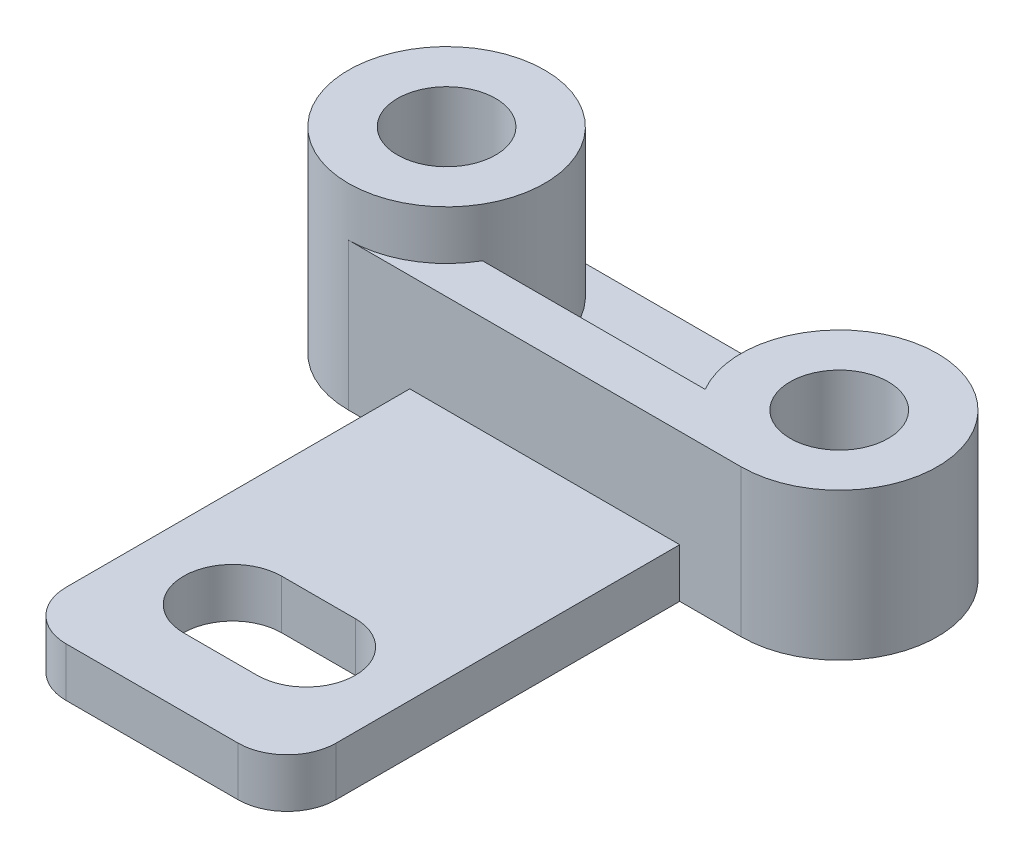
ISO-10303-21;
HEADER;
FILE_DESCRIPTION(('STEP AP214'),'2;1');
FILE_NAME('part.step','',(''),(''),'','','');
FILE_SCHEMA(('AUTOMOTIVE_DESIGN { 1 0 10303 214 1 1 1 1 }'));
ENDSEC;
DATA;
#1=APPLICATION_CONTEXT('core data for automotive mechanical design processes');
#2=APPLICATION_PROTOCOL_DEFINITION('international standard','automotive_design',2000,#1);
#3=PRODUCT_CONTEXT('',#1,'mechanical');
#4=PRODUCT('Part','Part','',(#3));
#5=PRODUCT_RELATED_PRODUCT_CATEGORY('part','',(#4));
#6=PRODUCT_DEFINITION_FORMATION('','',#4);
#7=PRODUCT_DEFINITION_CONTEXT('part definition',#1,'design');
#8=PRODUCT_DEFINITION('design','',#6,#7);
#9=PRODUCT_DEFINITION_SHAPE('','',#8);
#10=(LENGTH_UNIT() NAMED_UNIT(*) SI_UNIT(.MILLI.,.METRE.));
#11=(NAMED_UNIT(*) PLANE_ANGLE_UNIT() SI_UNIT($,.RADIAN.));
#12=(NAMED_UNIT(*) SI_UNIT($,.STERADIAN.) SOLID_ANGLE_UNIT());
#13=UNCERTAINTY_MEASURE_WITH_UNIT(LENGTH_MEASURE(1.E-05),#10,'distance_accuracy_value','');
#14=(GEOMETRIC_REPRESENTATION_CONTEXT(3) GLOBAL_UNCERTAINTY_ASSIGNED_CONTEXT((#13)) GLOBAL_UNIT_ASSIGNED_CONTEXT((#10,
#11,#12)) REPRESENTATION_CONTEXT('',''));
#15=CARTESIAN_POINT('',(0.,0.,0.));
#16=DIRECTION('',(0.,0.,1.));
#17=DIRECTION('',(1.,0.,0.));
#18=AXIS2_PLACEMENT_3D('',#15,#16,#17);
#19=CARTESIAN_POINT('',(0.,10.,0.));
#20=DIRECTION('',(0.,1.,0.));
#21=DIRECTION('',(0.,0.,1.));
#22=AXIS2_PLACEMENT_3D('',#19,#20,#21);
#23=PLANE('',#22);
#24=DIRECTION('',(0.,0.,-1.));
#25=VECTOR('',#24,1.);
#26=CARTESIAN_POINT('',(-27.5,10.,0.));
#27=LINE('',#26,#25);
#28=CARTESIAN_POINT('',(-27.5,10.,40.));
#29=VERTEX_POINT('',#28);
#30=CARTESIAN_POINT('',(-27.5,10.,-30.));
#31=VERTEX_POINT('',#30);
#32=EDGE_CURVE('E210',#29,#31,#27,.T.);
#33=ORIENTED_EDGE('',*,*,#32,.F.);
#34=CARTESIAN_POINT('',(-17.5,10.,40.));
#35=DIRECTION('',(0.,1.,0.));
#36=DIRECTION('',(0.,0.,1.));
#37=AXIS2_PLACEMENT_3D('',#34,#35,#36);
#38=CIRCLE('',#37,10.);
#39=CARTESIAN_POINT('',(-17.5,10.,50.));
#40=VERTEX_POINT('',#39);
#41=EDGE_CURVE('E56',#29,#40,#38,.T.);
#42=ORIENTED_EDGE('',*,*,#41,.T.);
#43=DIRECTION('',(1.,0.,0.));
#44=VECTOR('',#43,1.);
#45=CARTESIAN_POINT('',(0.,10.,50.));
#46=LINE('',#45,#44);
#47=CARTESIAN_POINT('',(17.5,10.,50.));
#48=VERTEX_POINT('',#47);
#49=EDGE_CURVE('E214',#40,#48,#46,.T.);
#50=ORIENTED_EDGE('',*,*,#49,.T.);
#51=CARTESIAN_POINT('',(17.5,10.,40.));
#52=DIRECTION('',(0.,1.,0.));
#53=DIRECTION('',(0.,0.,1.));
#54=AXIS2_PLACEMENT_3D('',#51,#52,#53);
#55=CIRCLE('',#54,10.);
#56=CARTESIAN_POINT('',(27.5,10.,40.));
#57=VERTEX_POINT('',#56);
#58=EDGE_CURVE('E63',#48,#57,#55,.T.);
#59=ORIENTED_EDGE('',*,*,#58,.T.);
#60=DIRECTION('',(0.,0.,-1.));
#61=VECTOR('',#60,1.);
#62=CARTESIAN_POINT('',(27.5,10.,0.));
#63=LINE('',#62,#61);
#64=CARTESIAN_POINT('',(27.5,10.,-30.));
#65=VERTEX_POINT('',#64);
#66=EDGE_CURVE('E217',#57,#65,#63,.T.);
#67=ORIENTED_EDGE('',*,*,#66,.T.);
#68=DIRECTION('',(1.,0.,0.));
#69=VECTOR('',#68,1.);
#70=CARTESIAN_POINT('',(0.,10.,-30.));
#71=LINE('',#70,#69);
#72=EDGE_CURVE('E178',#31,#65,#71,.T.);
#73=ORIENTED_EDGE('',*,*,#72,.F.);
#74=EDGE_LOOP('',(#33,#42,#50,#59,#67,#73));
#75=FACE_BOUND('',#74,.T.);
#76=CARTESIAN_POINT('',(7.5,10.,26.094203660327));
#77=DIRECTION('',(0.,1.,0.));
#78=DIRECTION('',(0.,0.,1.));
#79=AXIS2_PLACEMENT_3D('',#76,#77,#78);
#80=CIRCLE('',#79,10.);
#81=CARTESIAN_POINT('',(7.50000000000001,10.,36.094203660327));
#82=VERTEX_POINT('',#81);
#83=CARTESIAN_POINT('',(7.5,10.,16.094203660327));
#84=VERTEX_POINT('',#83);
#85=EDGE_CURVE('E220',#82,#84,#80,.T.);
#86=ORIENTED_EDGE('',*,*,#85,.F.);
#87=DIRECTION('',(1.,0.,0.));
#88=VECTOR('',#87,1.);
#89=CARTESIAN_POINT('',(0.,10.,36.094203660327));
#90=LINE('',#89,#88);
#91=CARTESIAN_POINT('',(-7.5,10.,36.094203660327));
#92=VERTEX_POINT('',#91);
#93=EDGE_CURVE('E224',#92,#82,#90,.T.);
#94=ORIENTED_EDGE('',*,*,#93,.F.);
#95=CARTESIAN_POINT('',(-7.5,10.,26.094203660327));
#96=DIRECTION('',(0.,1.,0.));
#97=DIRECTION('',(0.,0.,1.));
#98=AXIS2_PLACEMENT_3D('',#95,#96,#97);
#99=CIRCLE('',#98,10.);
#100=CARTESIAN_POINT('',(-7.5,10.,16.094203660327));
#101=VERTEX_POINT('',#100);
#102=EDGE_CURVE('E228',#101,#92,#99,.T.);
#103=ORIENTED_EDGE('',*,*,#102,.F.);
#104=DIRECTION('',(1.,0.,0.));
#105=VECTOR('',#104,1.);
#106=CARTESIAN_POINT('',(0.,10.,16.094203660327));
#107=LINE('',#106,#105);
#108=EDGE_CURVE('E232',#101,#84,#107,.T.);
#109=ORIENTED_EDGE('',*,*,#108,.T.);
#110=EDGE_LOOP('',(#86,#94,#103,#109));
#111=FACE_BOUND('',#110,.T.);
#112=ADVANCED_FACE('F47',(#75,#111),#23,.T.);
#113=CARTESIAN_POINT('',(7.5,10.,26.094203660327));
#114=DIRECTION('',(0.,-1.,0.));
#115=DIRECTION('',(0.,0.,-1.));
#116=AXIS2_PLACEMENT_3D('',#113,#114,#115);
#117=CYLINDRICAL_SURFACE('',#116,10.);
#118=CARTESIAN_POINT('',(7.5,0.,26.094203660327));
#119=DIRECTION('',(0.,1.,0.));
#120=DIRECTION('',(0.,0.,1.));
#121=AXIS2_PLACEMENT_3D('',#118,#119,#120);
#122=CIRCLE('',#121,10.);
#123=CARTESIAN_POINT('',(7.50000000000001,0.,36.094203660327));
#124=VERTEX_POINT('',#123);
#125=CARTESIAN_POINT('',(7.5,0.,16.094203660327));
#126=VERTEX_POINT('',#125);
#127=EDGE_CURVE('E265',#124,#126,#122,.T.);
#128=ORIENTED_EDGE('',*,*,#127,.F.);
#129=DIRECTION('',(0.,-1.,0.));
#130=VECTOR('',#129,1.);
#131=CARTESIAN_POINT('',(7.50000000000001,10.,36.094203660327));
#132=LINE('',#131,#130);
#133=EDGE_CURVE('E290',#82,#124,#132,.T.);
#134=ORIENTED_EDGE('',*,*,#133,.F.);
#135=ORIENTED_EDGE('',*,*,#85,.T.);
#136=DIRECTION('',(0.,-1.,0.));
#137=VECTOR('',#136,1.);
#138=CARTESIAN_POINT('',(7.5,10.,16.094203660327));
#139=LINE('',#138,#137);
#140=EDGE_CURVE('E280',#84,#126,#139,.T.);
#141=ORIENTED_EDGE('',*,*,#140,.T.);
#142=EDGE_LOOP('',(#128,#134,#135,#141));
#143=FACE_BOUND('',#142,.T.);
#144=ADVANCED_FACE('F395',(#143),#117,.F.);
#145=CARTESIAN_POINT('',(0.,10.,36.094203660327));
#146=DIRECTION('',(0.,0.,-1.));
#147=DIRECTION('',(-1.,0.,0.));
#148=AXIS2_PLACEMENT_3D('',#145,#146,#147);
#149=PLANE('',#148);
#150=DIRECTION('',(1.,0.,0.));
#151=VECTOR('',#150,1.);
#152=CARTESIAN_POINT('',(0.,0.,36.094203660327));
#153=LINE('',#152,#151);
#154=CARTESIAN_POINT('',(-7.5,0.,36.094203660327));
#155=VERTEX_POINT('',#154);
#156=EDGE_CURVE('E269',#155,#124,#153,.T.);
#157=ORIENTED_EDGE('',*,*,#156,.F.);
#158=DIRECTION('',(0.,-1.,0.));
#159=VECTOR('',#158,1.);
#160=CARTESIAN_POINT('',(-7.5,10.,36.094203660327));
#161=LINE('',#160,#159);
#162=EDGE_CURVE('E287',#92,#155,#161,.T.);
#163=ORIENTED_EDGE('',*,*,#162,.F.);
#164=ORIENTED_EDGE('',*,*,#93,.T.);
#165=ORIENTED_EDGE('',*,*,#133,.T.);
#166=EDGE_LOOP('',(#157,#163,#164,#165));
#167=FACE_BOUND('',#166,.T.);
#168=ADVANCED_FACE('F406',(#167),#149,.T.);
#169=CARTESIAN_POINT('',(-7.5,10.,26.094203660327));
#170=DIRECTION('',(0.,-1.,0.));
#171=DIRECTION('',(0.,0.,-1.));
#172=AXIS2_PLACEMENT_3D('',#169,#170,#171);
#173=CYLINDRICAL_SURFACE('',#172,10.);
#174=CARTESIAN_POINT('',(-7.5,0.,26.094203660327));
#175=DIRECTION('',(0.,1.,0.));
#176=DIRECTION('',(0.,0.,1.));
#177=AXIS2_PLACEMENT_3D('',#174,#175,#176);
#178=CIRCLE('',#177,10.);
#179=CARTESIAN_POINT('',(-7.5,0.,16.094203660327));
#180=VERTEX_POINT('',#179);
#181=EDGE_CURVE('E273',#180,#155,#178,.T.);
#182=ORIENTED_EDGE('',*,*,#181,.F.);
#183=DIRECTION('',(0.,-1.,0.));
#184=VECTOR('',#183,1.);
#185=CARTESIAN_POINT('',(-7.5,10.,16.094203660327));
#186=LINE('',#185,#184);
#187=EDGE_CURVE('E283',#101,#180,#186,.T.);
#188=ORIENTED_EDGE('',*,*,#187,.F.);
#189=ORIENTED_EDGE('',*,*,#102,.T.);
#190=ORIENTED_EDGE('',*,*,#162,.T.);
#191=EDGE_LOOP('',(#182,#188,#189,#190));
#192=FACE_BOUND('',#191,.T.);
#193=ADVANCED_FACE('F403',(#192),#173,.F.);
#194=CARTESIAN_POINT('',(40.,10.,-50.));
#195=DIRECTION('',(0.,-1.,0.));
#196=DIRECTION('',(0.,0.,-1.));
#197=AXIS2_PLACEMENT_3D('',#194,#195,#196);
#198=CYLINDRICAL_SURFACE('',#197,20.);
#199=CARTESIAN_POINT('',(40.,0.,-50.));
#200=DIRECTION('',(0.,1.,0.));
#201=DIRECTION('',(0.,0.,1.));
#202=AXIS2_PLACEMENT_3D('',#199,#200,#201);
#203=CIRCLE('',#202,20.);
#204=CARTESIAN_POINT('',(40.,0.,-70.));
#205=VERTEX_POINT('',#204);
#206=CARTESIAN_POINT('',(40.,0.,-30.));
#207=VERTEX_POINT('',#206);
#208=EDGE_CURVE('E239',#205,#207,#203,.F.);
#209=ORIENTED_EDGE('',*,*,#208,.F.);
#210=DIRECTION('',(0.,-1.,0.));
#211=VECTOR('',#210,1.);
#212=CARTESIAN_POINT('',(40.,10.,-70.));
#213=LINE('',#212,#211);
#214=CARTESIAN_POINT('',(40.,10.,-70.));
#215=VERTEX_POINT('',#214);
#216=EDGE_CURVE('E306',#215,#205,#213,.T.);
#217=ORIENTED_EDGE('',*,*,#216,.F.);
#218=CARTESIAN_POINT('',(40.,10.,-50.));
#219=DIRECTION('',(0.,1.,0.));
#220=DIRECTION('',(0.,0.,1.));
#221=AXIS2_PLACEMENT_3D('',#218,#219,#220);
#222=CIRCLE('',#221,20.);
#223=CARTESIAN_POINT('',(22.6794919243113,10.,-40.));
#224=VERTEX_POINT('',#223);
#225=EDGE_CURVE('E293',#215,#224,#222,.T.);
#226=ORIENTED_EDGE('',*,*,#225,.T.);
#227=DIRECTION('',(0.,-1.,0.));
#228=VECTOR('',#227,1.);
#229=CARTESIAN_POINT('',(22.6794919243113,30.,-40.));
#230=LINE('',#229,#228);
#231=CARTESIAN_POINT('',(22.6794919243113,30.,-40.));
#232=VERTEX_POINT('',#231);
#233=EDGE_CURVE('E196',#232,#224,#230,.T.);
#234=ORIENTED_EDGE('',*,*,#233,.F.);
#235=CARTESIAN_POINT('',(40.,30.,-50.));
#236=DIRECTION('',(0.,1.,0.));
#237=DIRECTION('',(0.,0.,1.));
#238=AXIS2_PLACEMENT_3D('',#235,#236,#237);
#239=CIRCLE('',#238,20.);
#240=CARTESIAN_POINT('',(40.,30.,-30.));
#241=VERTEX_POINT('',#240);
#242=EDGE_CURVE('E184',#241,#232,#239,.T.);
#243=ORIENTED_EDGE('',*,*,#242,.F.);
#244=DIRECTION('',(0.,-1.,0.));
#245=VECTOR('',#244,1.);
#246=CARTESIAN_POINT('',(40.,10.,-30.));
#247=LINE('',#246,#245);
#248=EDGE_CURVE('E284',#241,#207,#247,.T.);
#249=ORIENTED_EDGE('',*,*,#248,.T.);
#250=EDGE_LOOP('',(#209,#217,#226,#234,#243,#249));
#251=FACE_BOUND('',#250,.T.);
#252=ADVANCED_FACE('F425',(#251),#198,.T.);
#253=CARTESIAN_POINT('',(0.,10.,-70.));
#254=DIRECTION('',(0.,0.,-1.));
#255=DIRECTION('',(-1.,0.,0.));
#256=AXIS2_PLACEMENT_3D('',#253,#254,#255);
#257=PLANE('',#256);
#258=DIRECTION('',(1.,0.,0.));
#259=VECTOR('',#258,1.);
#260=CARTESIAN_POINT('',(0.,0.,-70.));
#261=LINE('',#260,#259);
#262=CARTESIAN_POINT('',(-40.,0.,-70.));
#263=VERTEX_POINT('',#262);
#264=EDGE_CURVE('E244',#263,#205,#261,.T.);
#265=ORIENTED_EDGE('',*,*,#264,.F.);
#266=DIRECTION('',(0.,-1.,0.));
#267=VECTOR('',#266,1.);
#268=CARTESIAN_POINT('',(-40.,10.,-70.));
#269=LINE('',#268,#267);
#270=CARTESIAN_POINT('',(-40.,10.,-70.));
#271=VERTEX_POINT('',#270);
#272=EDGE_CURVE('E303',#271,#263,#269,.T.);
#273=ORIENTED_EDGE('',*,*,#272,.F.);
#274=DIRECTION('',(1.,0.,0.));
#275=VECTOR('',#274,1.);
#276=CARTESIAN_POINT('',(0.,10.,-70.));
#277=LINE('',#276,#275);
#278=EDGE_CURVE('E206',#271,#215,#277,.T.);
#279=ORIENTED_EDGE('',*,*,#278,.T.);
#280=ORIENTED_EDGE('',*,*,#216,.T.);
#281=EDGE_LOOP('',(#265,#273,#279,#280));
#282=FACE_BOUND('',#281,.T.);
#283=ADVANCED_FACE('F428',(#282),#257,.T.);
#284=CARTESIAN_POINT('',(-40.,10.,-50.));
#285=DIRECTION('',(0.,-1.,0.));
#286=DIRECTION('',(0.,0.,-1.));
#287=AXIS2_PLACEMENT_3D('',#284,#285,#286);
#288=CYLINDRICAL_SURFACE('',#287,20.);
#289=CARTESIAN_POINT('',(-40.,10.,-50.));
#290=DIRECTION('',(0.,1.,0.));
#291=DIRECTION('',(0.,0.,1.));
#292=AXIS2_PLACEMENT_3D('',#289,#290,#291);
#293=CIRCLE('',#292,20.);
#294=CARTESIAN_POINT('',(-22.6794919243112,10.,-40.));
#295=VERTEX_POINT('',#294);
#296=EDGE_CURVE('E355',#295,#271,#293,.T.);
#297=ORIENTED_EDGE('',*,*,#296,.T.);
#298=ORIENTED_EDGE('',*,*,#272,.T.);
#299=CARTESIAN_POINT('',(-40.,0.,-50.));
#300=DIRECTION('',(0.,1.,0.));
#301=DIRECTION('',(0.,0.,1.));
#302=AXIS2_PLACEMENT_3D('',#299,#300,#301);
#303=CIRCLE('',#302,20.);
#304=CARTESIAN_POINT('',(-40.,0.,-30.));
#305=VERTEX_POINT('',#304);
#306=EDGE_CURVE('E248',#263,#305,#303,.T.);
#307=ORIENTED_EDGE('',*,*,#306,.T.);
#308=DIRECTION('',(0.,-1.,0.));
#309=VECTOR('',#308,1.);
#310=CARTESIAN_POINT('',(-40.,10.,-30.));
#311=LINE('',#310,#309);
#312=CARTESIAN_POINT('',(-40.,30.,-30.));
#313=VERTEX_POINT('',#312);
#314=EDGE_CURVE('E172',#313,#305,#311,.T.);
#315=ORIENTED_EDGE('',*,*,#314,.F.);
#316=CARTESIAN_POINT('',(-40.,30.,-50.));
#317=DIRECTION('',(0.,1.,0.));
#318=DIRECTION('',(0.,0.,1.));
#319=AXIS2_PLACEMENT_3D('',#316,#317,#318);
#320=CIRCLE('',#319,20.);
#321=CARTESIAN_POINT('',(-22.6794919243112,30.,-40.));
#322=VERTEX_POINT('',#321);
#323=EDGE_CURVE('E163',#322,#313,#320,.F.);
#324=ORIENTED_EDGE('',*,*,#323,.F.);
#325=DIRECTION('',(0.,-1.,0.));
#326=VECTOR('',#325,1.);
#327=CARTESIAN_POINT('',(-22.6794919243112,30.,-40.));
#328=LINE('',#327,#326);
#329=EDGE_CURVE('E169',#322,#295,#328,.T.);
#330=ORIENTED_EDGE('',*,*,#329,.T.);
#331=EDGE_LOOP('',(#297,#298,#307,#315,#324,#330));
#332=FACE_BOUND('',#331,.T.);
#333=CARTESIAN_POINT('',(-40.,40.,-50.));
#334=DIRECTION('',(0.,1.,0.));
#335=DIRECTION('',(0.,0.,1.));
#336=AXIS2_PLACEMENT_3D('',#333,#334,#335);
#337=CIRCLE('',#336,20.);
#338=CARTESIAN_POINT('',(-40.,40.,-30.));
#339=VERTEX_POINT('',#338);
#340=EDGE_CURVE('E360',#339,#339,#337,.T.);
#341=ORIENTED_EDGE('',*,*,#340,.F.);
#342=EDGE_LOOP('',(#341));
#343=FACE_BOUND('',#342,.T.);
#344=ADVANCED_FACE('F166',(#332,#343),#288,.T.);
#345=CARTESIAN_POINT('',(0.,10.,-30.));
#346=DIRECTION('',(0.,0.,-1.));
#347=DIRECTION('',(-1.,0.,0.));
#348=AXIS2_PLACEMENT_3D('',#345,#346,#347);
#349=PLANE('',#348);
#350=DIRECTION('',(1.,0.,0.));
#351=VECTOR('',#350,1.);
#352=CARTESIAN_POINT('',(0.,0.,-30.));
#353=LINE('',#352,#351);
#354=CARTESIAN_POINT('',(-27.5,0.,-30.));
#355=VERTEX_POINT('',#354);
#356=EDGE_CURVE('E240',#305,#355,#353,.T.);
#357=ORIENTED_EDGE('',*,*,#356,.T.);
#358=DIRECTION('',(0.,-1.,0.));
#359=VECTOR('',#358,1.);
#360=CARTESIAN_POINT('',(-27.5,10.,-30.));
#361=LINE('',#360,#359);
#362=EDGE_CURVE('E297',#31,#355,#361,.T.);
#363=ORIENTED_EDGE('',*,*,#362,.F.);
#364=ORIENTED_EDGE('',*,*,#72,.T.);
#365=DIRECTION('',(0.,-1.,0.));
#366=VECTOR('',#365,1.);
#367=CARTESIAN_POINT('',(27.5,10.,-30.));
#368=LINE('',#367,#366);
#369=CARTESIAN_POINT('',(27.5,0.,-30.));
#370=VERTEX_POINT('',#369);
#371=EDGE_CURVE('E234',#65,#370,#368,.T.);
#372=ORIENTED_EDGE('',*,*,#371,.T.);
#373=EDGE_CURVE('E201',#370,#207,#353,.T.);
#374=ORIENTED_EDGE('',*,*,#373,.T.);
#375=ORIENTED_EDGE('',*,*,#248,.F.);
#376=DIRECTION('',(1.,0.,0.));
#377=VECTOR('',#376,1.);
#378=CARTESIAN_POINT('',(0.,30.,-30.));
#379=LINE('',#378,#377);
#380=EDGE_CURVE('E189',#313,#241,#379,.T.);
#381=ORIENTED_EDGE('',*,*,#380,.F.);
#382=ORIENTED_EDGE('',*,*,#314,.T.);
#383=EDGE_LOOP('',(#357,#363,#364,#372,#374,#375,#381,#382));
#384=FACE_BOUND('',#383,.T.);
#385=ADVANCED_FACE('F347',(#384),#349,.F.);
#386=CARTESIAN_POINT('',(-27.5,10.,0.));
#387=DIRECTION('',(-1.,0.,0.));
#388=DIRECTION('',(0.,0.,1.));
#389=AXIS2_PLACEMENT_3D('',#386,#387,#388);
#390=PLANE('',#389);
#391=DIRECTION('',(0.,0.,-1.));
#392=VECTOR('',#391,1.);
#393=CARTESIAN_POINT('',(-27.5,0.,0.));
#394=LINE('',#393,#392);
#395=CARTESIAN_POINT('',(-27.5,0.,40.));
#396=VERTEX_POINT('',#395);
#397=EDGE_CURVE('E251',#396,#355,#394,.T.);
#398=ORIENTED_EDGE('',*,*,#397,.F.);
#399=DIRECTION('',(0.,-1.,0.));
#400=VECTOR('',#399,1.);
#401=CARTESIAN_POINT('',(-27.5,10.,40.));
#402=LINE('',#401,#400);
#403=EDGE_CURVE('E71',#396,#29,#402,.F.);
#404=ORIENTED_EDGE('',*,*,#403,.T.);
#405=ORIENTED_EDGE('',*,*,#32,.T.);
#406=ORIENTED_EDGE('',*,*,#362,.T.);
#407=EDGE_LOOP('',(#398,#404,#405,#406));
#408=FACE_BOUND('',#407,.T.);
#409=ADVANCED_FACE('F342',(#408),#390,.T.);
#410=CARTESIAN_POINT('',(0.,10.,50.));
#411=DIRECTION('',(0.,0.,-1.));
#412=DIRECTION('',(-1.,0.,0.));
#413=AXIS2_PLACEMENT_3D('',#410,#411,#412);
#414=PLANE('',#413);
#415=ORIENTED_EDGE('',*,*,#49,.F.);
#416=DIRECTION('',(0.,-1.,0.));
#417=VECTOR('',#416,1.);
#418=CARTESIAN_POINT('',(-17.5,0.,50.));
#419=LINE('',#418,#417);
#420=CARTESIAN_POINT('',(-17.5,0.,50.));
#421=VERTEX_POINT('',#420);
#422=EDGE_CURVE('E313',#40,#421,#419,.T.);
#423=ORIENTED_EDGE('',*,*,#422,.T.);
#424=DIRECTION('',(1.,0.,0.));
#425=VECTOR('',#424,1.);
#426=CARTESIAN_POINT('',(0.,0.,50.));
#427=LINE('',#426,#425);
#428=CARTESIAN_POINT('',(17.5,0.,50.));
#429=VERTEX_POINT('',#428);
#430=EDGE_CURVE('E254',#421,#429,#427,.T.);
#431=ORIENTED_EDGE('',*,*,#430,.T.);
#432=DIRECTION('',(0.,-1.,0.));
#433=VECTOR('',#432,1.);
#434=CARTESIAN_POINT('',(17.5,10.,50.));
#435=LINE('',#434,#433);
#436=EDGE_CURVE('E177',#429,#48,#435,.F.);
#437=ORIENTED_EDGE('',*,*,#436,.T.);
#438=EDGE_LOOP('',(#415,#423,#431,#437));
#439=FACE_BOUND('',#438,.T.);
#440=ADVANCED_FACE('F334',(#439),#414,.F.);
#441=CARTESIAN_POINT('',(-40.,10.,-50.));
#442=DIRECTION('',(0.,-1.,0.));
#443=DIRECTION('',(0.,0.,-1.));
#444=AXIS2_PLACEMENT_3D('',#441,#442,#443);
#445=CYLINDRICAL_SURFACE('',#444,10.);
#446=CARTESIAN_POINT('',(-40.,40.,-50.));
#447=DIRECTION('',(0.,1.,0.));
#448=DIRECTION('',(0.,0.,1.));
#449=AXIS2_PLACEMENT_3D('',#446,#447,#448);
#450=CIRCLE('',#449,10.);
#451=CARTESIAN_POINT('',(-40.,40.,-40.));
#452=VERTEX_POINT('',#451);
#453=EDGE_CURVE('E371',#452,#452,#450,.F.);
#454=ORIENTED_EDGE('',*,*,#453,.F.);
#455=EDGE_LOOP('',(#454));
#456=FACE_BOUND('',#455,.T.);
#457=CARTESIAN_POINT('',(-40.,0.,-50.));
#458=DIRECTION('',(0.,1.,0.));
#459=DIRECTION('',(0.,0.,1.));
#460=AXIS2_PLACEMENT_3D('',#457,#458,#459);
#461=CIRCLE('',#460,10.);
#462=CARTESIAN_POINT('',(-40.,0.,-40.));
#463=VERTEX_POINT('',#462);
#464=EDGE_CURVE('E261',#463,#463,#461,.T.);
#465=ORIENTED_EDGE('',*,*,#464,.F.);
#466=EDGE_LOOP('',(#465));
#467=FACE_BOUND('',#466,.T.);
#468=ADVANCED_FACE('F379',(#456,#467),#445,.F.);
#469=CARTESIAN_POINT('',(27.5,10.,0.));
#470=DIRECTION('',(-1.,0.,0.));
#471=DIRECTION('',(0.,0.,1.));
#472=AXIS2_PLACEMENT_3D('',#469,#470,#471);
#473=PLANE('',#472);
#474=ORIENTED_EDGE('',*,*,#66,.F.);
#475=DIRECTION('',(0.,-1.,0.));
#476=VECTOR('',#475,1.);
#477=CARTESIAN_POINT('',(27.5,10.,40.));
#478=LINE('',#477,#476);
#479=CARTESIAN_POINT('',(27.5,0.,40.));
#480=VERTEX_POINT('',#479);
#481=EDGE_CURVE('E11',#57,#480,#478,.T.);
#482=ORIENTED_EDGE('',*,*,#481,.T.);
#483=DIRECTION('',(0.,0.,-1.));
#484=VECTOR('',#483,1.);
#485=CARTESIAN_POINT('',(27.5,0.,0.));
#486=LINE('',#485,#484);
#487=EDGE_CURVE('E258',#480,#370,#486,.T.);
#488=ORIENTED_EDGE('',*,*,#487,.T.);
#489=ORIENTED_EDGE('',*,*,#371,.F.);
#490=EDGE_LOOP('',(#474,#482,#488,#489));
#491=FACE_BOUND('',#490,.T.);
#492=ADVANCED_FACE('F382',(#491),#473,.F.);
#493=CARTESIAN_POINT('',(40.,10.,-50.));
#494=DIRECTION('',(0.,-1.,0.));
#495=DIRECTION('',(0.,0.,-1.));
#496=AXIS2_PLACEMENT_3D('',#493,#494,#495);
#497=CYLINDRICAL_SURFACE('',#496,9.99999999999998);
#498=CARTESIAN_POINT('',(40.,0.,-50.));
#499=DIRECTION('',(0.,1.,0.));
#500=DIRECTION('',(0.,0.,1.));
#501=AXIS2_PLACEMENT_3D('',#498,#499,#500);
#502=CIRCLE('',#501,9.99999999999998);
#503=CARTESIAN_POINT('',(40.,0.,-40.));
#504=VERTEX_POINT('',#503);
#505=EDGE_CURVE('E195',#504,#504,#502,.F.);
#506=ORIENTED_EDGE('',*,*,#505,.T.);
#507=EDGE_LOOP('',(#506));
#508=FACE_BOUND('',#507,.T.);
#509=CARTESIAN_POINT('',(40.,30.,-50.));
#510=DIRECTION('',(0.,1.,0.));
#511=DIRECTION('',(0.,0.,1.));
#512=AXIS2_PLACEMENT_3D('',#509,#510,#511);
#513=CIRCLE('',#512,9.99999999999998);
#514=CARTESIAN_POINT('',(40.,30.,-40.));
#515=VERTEX_POINT('',#514);
#516=EDGE_CURVE('E190',#515,#515,#513,.F.);
#517=ORIENTED_EDGE('',*,*,#516,.F.);
#518=EDGE_LOOP('',(#517));
#519=FACE_BOUND('',#518,.T.);
#520=ADVANCED_FACE('F419',(#508,#519),#497,.F.);
#521=CARTESIAN_POINT('',(0.,10.,16.094203660327));
#522=DIRECTION('',(0.,0.,-1.));
#523=DIRECTION('',(-1.,0.,0.));
#524=AXIS2_PLACEMENT_3D('',#521,#522,#523);
#525=PLANE('',#524);
#526=DIRECTION('',(1.,0.,0.));
#527=VECTOR('',#526,1.);
#528=CARTESIAN_POINT('',(0.,0.,16.094203660327));
#529=LINE('',#528,#527);
#530=EDGE_CURVE('E211',#180,#126,#529,.T.);
#531=ORIENTED_EDGE('',*,*,#530,.T.);
#532=ORIENTED_EDGE('',*,*,#140,.F.);
#533=ORIENTED_EDGE('',*,*,#108,.F.);
#534=ORIENTED_EDGE('',*,*,#187,.T.);
#535=EDGE_LOOP('',(#531,#532,#533,#534));
#536=FACE_BOUND('',#535,.T.);
#537=ADVANCED_FACE('F400',(#536),#525,.F.);
#538=ORIENTED_EDGE('',*,*,#225,.F.);
#539=ORIENTED_EDGE('',*,*,#278,.F.);
#540=ORIENTED_EDGE('',*,*,#296,.F.);
#541=DIRECTION('',(-1.,0.,0.));
#542=VECTOR('',#541,1.);
#543=CARTESIAN_POINT('',(0.,10.,-40.));
#544=LINE('',#543,#542);
#545=EDGE_CURVE('E193',#224,#295,#544,.T.);
#546=ORIENTED_EDGE('',*,*,#545,.F.);
#547=EDGE_LOOP('',(#538,#539,#540,#546));
#548=FACE_BOUND('',#547,.T.);
#549=ADVANCED_FACE('F387',(#548),#23,.T.);
#550=CARTESIAN_POINT('',(0.,0.,0.));
#551=DIRECTION('',(0.,1.,0.));
#552=DIRECTION('',(0.,0.,1.));
#553=AXIS2_PLACEMENT_3D('',#550,#551,#552);
#554=PLANE('',#553);
#555=ORIENTED_EDGE('',*,*,#505,.F.);
#556=EDGE_LOOP('',(#555));
#557=FACE_BOUND('',#556,.T.);
#558=ORIENTED_EDGE('',*,*,#430,.F.);
#559=CARTESIAN_POINT('',(-17.5,0.,40.));
#560=DIRECTION('',(0.,1.,0.));
#561=DIRECTION('',(0.,0.,1.));
#562=AXIS2_PLACEMENT_3D('',#559,#560,#561);
#563=CIRCLE('',#562,10.);
#564=EDGE_CURVE('E320',#421,#396,#563,.F.);
#565=ORIENTED_EDGE('',*,*,#564,.T.);
#566=ORIENTED_EDGE('',*,*,#397,.T.);
#567=ORIENTED_EDGE('',*,*,#356,.F.);
#568=ORIENTED_EDGE('',*,*,#306,.F.);
#569=ORIENTED_EDGE('',*,*,#264,.T.);
#570=ORIENTED_EDGE('',*,*,#208,.T.);
#571=ORIENTED_EDGE('',*,*,#373,.F.);
#572=ORIENTED_EDGE('',*,*,#487,.F.);
#573=CARTESIAN_POINT('',(17.5,0.,40.));
#574=DIRECTION('',(0.,1.,0.));
#575=DIRECTION('',(0.,0.,1.));
#576=AXIS2_PLACEMENT_3D('',#573,#574,#575);
#577=CIRCLE('',#576,10.);
#578=EDGE_CURVE('E317',#480,#429,#577,.F.);
#579=ORIENTED_EDGE('',*,*,#578,.T.);
#580=EDGE_LOOP('',(#558,#565,#566,#567,#568,#569,#570,#571,#572,#579));
#581=FACE_BOUND('',#580,.T.);
#582=ORIENTED_EDGE('',*,*,#464,.T.);
#583=EDGE_LOOP('',(#582));
#584=FACE_BOUND('',#583,.T.);
#585=ORIENTED_EDGE('',*,*,#127,.T.);
#586=ORIENTED_EDGE('',*,*,#530,.F.);
#587=ORIENTED_EDGE('',*,*,#181,.T.);
#588=ORIENTED_EDGE('',*,*,#156,.T.);
#589=EDGE_LOOP('',(#585,#586,#587,#588));
#590=FACE_BOUND('',#589,.T.);
#591=ADVANCED_FACE('F339',(#557,#581,#584,#590),#554,.F.);
#592=CARTESIAN_POINT('',(0.,30.,-40.));
#593=DIRECTION('',(0.,0.,1.));
#594=DIRECTION('',(1.,0.,0.));
#595=AXIS2_PLACEMENT_3D('',#592,#593,#594);
#596=PLANE('',#595);
#597=ORIENTED_EDGE('',*,*,#545,.T.);
#598=ORIENTED_EDGE('',*,*,#329,.F.);
#599=DIRECTION('',(-1.,0.,0.));
#600=VECTOR('',#599,1.);
#601=CARTESIAN_POINT('',(0.,30.,-40.));
#602=LINE('',#601,#600);
#603=EDGE_CURVE('E181',#232,#322,#602,.T.);
#604=ORIENTED_EDGE('',*,*,#603,.F.);
#605=ORIENTED_EDGE('',*,*,#233,.T.);
#606=EDGE_LOOP('',(#597,#598,#604,#605));
#607=FACE_BOUND('',#606,.T.);
#608=ADVANCED_FACE('F192',(#607),#596,.F.);
#609=CARTESIAN_POINT('',(0.,30.,0.));
#610=DIRECTION('',(0.,1.,0.));
#611=DIRECTION('',(0.,0.,1.));
#612=AXIS2_PLACEMENT_3D('',#609,#610,#611);
#613=PLANE('',#612);
#614=ORIENTED_EDGE('',*,*,#516,.T.);
#615=EDGE_LOOP('',(#614));
#616=FACE_BOUND('',#615,.T.);
#617=ORIENTED_EDGE('',*,*,#603,.T.);
#618=ORIENTED_EDGE('',*,*,#323,.T.);
#619=ORIENTED_EDGE('',*,*,#380,.T.);
#620=ORIENTED_EDGE('',*,*,#242,.T.);
#621=EDGE_LOOP('',(#617,#618,#619,#620));
#622=FACE_BOUND('',#621,.T.);
#623=ADVANCED_FACE('F182',(#616,#622),#613,.T.);
#624=CARTESIAN_POINT('',(0.,40.,0.));
#625=DIRECTION('',(0.,1.,0.));
#626=DIRECTION('',(0.,0.,1.));
#627=AXIS2_PLACEMENT_3D('',#624,#625,#626);
#628=PLANE('',#627);
#629=ORIENTED_EDGE('',*,*,#453,.T.);
#630=EDGE_LOOP('',(#629));
#631=FACE_BOUND('',#630,.T.);
#632=ORIENTED_EDGE('',*,*,#340,.T.);
#633=EDGE_LOOP('',(#632));
#634=FACE_BOUND('',#633,.T.);
#635=ADVANCED_FACE('F376',(#631,#634),#628,.T.);
#636=CARTESIAN_POINT('',(-17.5,10.,40.));
#637=DIRECTION('',(0.,1.,0.));
#638=DIRECTION('',(0.,0.,1.));
#639=AXIS2_PLACEMENT_3D('',#636,#637,#638);
#640=CYLINDRICAL_SURFACE('',#639,10.);
#641=ORIENTED_EDGE('',*,*,#41,.F.);
#642=ORIENTED_EDGE('',*,*,#403,.F.);
#643=ORIENTED_EDGE('',*,*,#564,.F.);
#644=ORIENTED_EDGE('',*,*,#422,.F.);
#645=EDGE_LOOP('',(#641,#642,#643,#644));
#646=FACE_BOUND('',#645,.T.);
#647=ADVANCED_FACE('F337',(#646),#640,.T.);
#648=CARTESIAN_POINT('',(17.5,10.,40.));
#649=DIRECTION('',(0.,-1.,0.));
#650=DIRECTION('',(0.,0.,-1.));
#651=AXIS2_PLACEMENT_3D('',#648,#649,#650);
#652=CYLINDRICAL_SURFACE('',#651,10.);
#653=ORIENTED_EDGE('',*,*,#58,.F.);
#654=ORIENTED_EDGE('',*,*,#436,.F.);
#655=ORIENTED_EDGE('',*,*,#578,.F.);
#656=ORIENTED_EDGE('',*,*,#481,.F.);
#657=EDGE_LOOP('',(#653,#654,#655,#656));
#658=FACE_BOUND('',#657,.T.);
#659=ADVANCED_FACE('F49',(#658),#652,.T.);
#660=CLOSED_SHELL('',(#112,#144,#168,#193,#252,#283,#344,#385,#409,#440,#468,#492,#520,#537,
#549,#591,#608,#623,#635,#647,#659));
#661=MANIFOLD_SOLID_BREP('B2',#660);
#662=ADVANCED_BREP_SHAPE_REPRESENTATION('',(#18,#661),#14);
#663=SHAPE_DEFINITION_REPRESENTATION(#9,#662);
ENDSEC;
END-ISO-10303-21;
